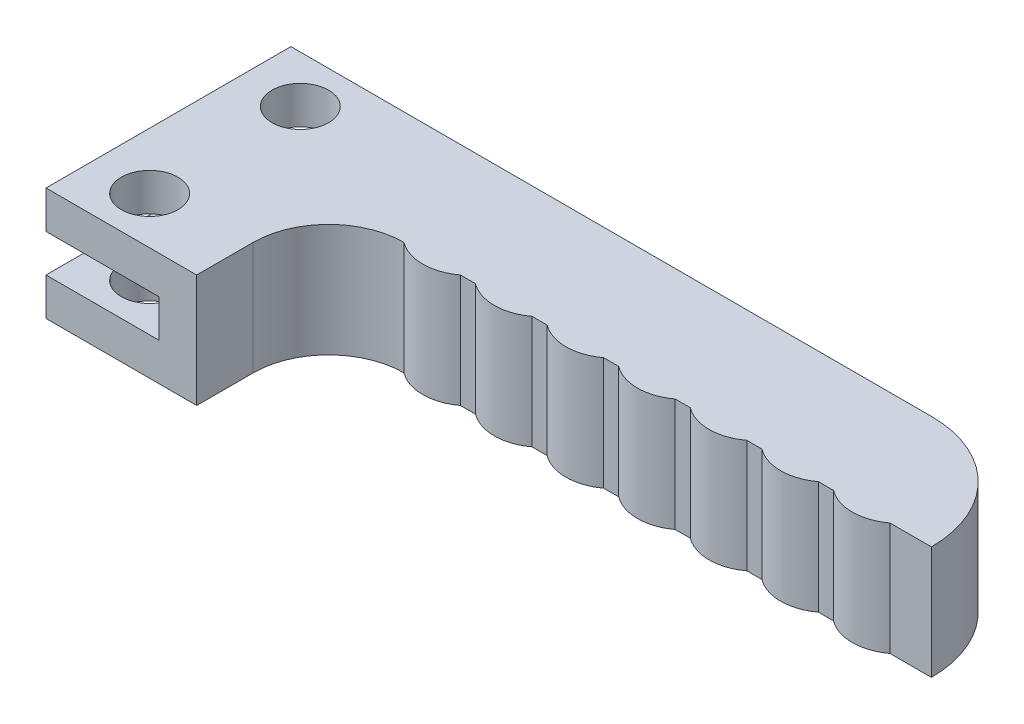
ISO-10303-21;
HEADER;
FILE_DESCRIPTION(('STEP AP214'),'2;1');
FILE_NAME('part.step','',(''),(''),'','','');
FILE_SCHEMA(('AUTOMOTIVE_DESIGN { 1 0 10303 214 1 1 1 1 }'));
ENDSEC;
DATA;
#1=APPLICATION_CONTEXT('core data for automotive mechanical design processes');
#2=APPLICATION_PROTOCOL_DEFINITION('international standard','automotive_design',2000,#1);
#3=PRODUCT_CONTEXT('',#1,'mechanical');
#4=PRODUCT('Part','Part','',(#3));
#5=PRODUCT_RELATED_PRODUCT_CATEGORY('part','',(#4));
#6=PRODUCT_DEFINITION_FORMATION('','',#4);
#7=PRODUCT_DEFINITION_CONTEXT('part definition',#1,'design');
#8=PRODUCT_DEFINITION('design','',#6,#7);
#9=PRODUCT_DEFINITION_SHAPE('','',#8);
#10=(LENGTH_UNIT() NAMED_UNIT(*) SI_UNIT(.MILLI.,.METRE.));
#11=(NAMED_UNIT(*) PLANE_ANGLE_UNIT() SI_UNIT($,.RADIAN.));
#12=(NAMED_UNIT(*) SI_UNIT($,.STERADIAN.) SOLID_ANGLE_UNIT());
#13=UNCERTAINTY_MEASURE_WITH_UNIT(LENGTH_MEASURE(1.E-05),#10,'distance_accuracy_value','');
#14=(GEOMETRIC_REPRESENTATION_CONTEXT(3) GLOBAL_UNCERTAINTY_ASSIGNED_CONTEXT((#13)) GLOBAL_UNIT_ASSIGNED_CONTEXT((#10,
#11,#12)) REPRESENTATION_CONTEXT('',''));
#15=CARTESIAN_POINT('',(0.,0.,0.));
#16=DIRECTION('',(0.,0.,1.));
#17=DIRECTION('',(1.,0.,0.));
#18=AXIS2_PLACEMENT_3D('',#15,#16,#17);
#19=CARTESIAN_POINT('',(-6.50000000000003,0.,-2.50000000000002));
#20=DIRECTION('',(0.,1.,0.));
#21=DIRECTION('',(0.,0.,1.));
#22=AXIS2_PLACEMENT_3D('',#19,#20,#21);
#23=CYLINDRICAL_SURFACE('',#22,2.50000000000001);
#24=CARTESIAN_POINT('',(-6.50000000000003,0.,-2.50000000000002));
#25=DIRECTION('',(0.,1.,0.));
#26=DIRECTION('',(0.,0.,1.));
#27=AXIS2_PLACEMENT_3D('',#24,#25,#26);
#28=CIRCLE('',#27,2.50000000000001);
#29=CARTESIAN_POINT('',(-8.00000000000002,0.,-0.5));
#30=VERTEX_POINT('',#29);
#31=CARTESIAN_POINT('',(-5.00000000000004,0.,-0.5));
#32=VERTEX_POINT('',#31);
#33=EDGE_CURVE('E11',#30,#32,#28,.T.);
#34=ORIENTED_EDGE('',*,*,#33,.T.);
#35=DIRECTION('',(0.,1.,0.));
#36=VECTOR('',#35,1.);
#37=CARTESIAN_POINT('',(-5.00000000000004,0.,-0.5));
#38=LINE('',#37,#36);
#39=CARTESIAN_POINT('',(-5.00000000000004,6.,-0.5));
#40=VERTEX_POINT('',#39);
#41=EDGE_CURVE('E373',#32,#40,#38,.T.);
#42=ORIENTED_EDGE('',*,*,#41,.T.);
#43=CARTESIAN_POINT('',(-6.50000000000003,6.,-2.50000000000002));
#44=DIRECTION('',(0.,1.,0.));
#45=DIRECTION('',(0.,0.,1.));
#46=AXIS2_PLACEMENT_3D('',#43,#44,#45);
#47=CIRCLE('',#46,2.50000000000001);
#48=CARTESIAN_POINT('',(-8.,6.,-0.5));
#49=VERTEX_POINT('',#48);
#50=EDGE_CURVE('E36',#49,#40,#47,.T.);
#51=ORIENTED_EDGE('',*,*,#50,.F.);
#52=DIRECTION('',(0.,-1.,0.));
#53=VECTOR('',#52,1.);
#54=CARTESIAN_POINT('',(-8.,0.,-0.5));
#55=LINE('',#54,#53);
#56=EDGE_CURVE('E27',#49,#30,#55,.T.);
#57=ORIENTED_EDGE('',*,*,#56,.T.);
#58=EDGE_LOOP('',(#34,#42,#51,#57));
#59=FACE_BOUND('',#58,.T.);
#60=ADVANCED_FACE('F17',(#59),#23,.T.);
#61=CARTESIAN_POINT('',(-2.70000000000003,0.,-2.50000000000004));
#62=DIRECTION('',(0.,1.,0.));
#63=DIRECTION('',(0.,0.,1.));
#64=AXIS2_PLACEMENT_3D('',#61,#62,#63);
#65=CYLINDRICAL_SURFACE('',#64,2.5);
#66=CARTESIAN_POINT('',(-2.70000000000003,0.,-2.50000000000004));
#67=DIRECTION('',(0.,1.,0.));
#68=DIRECTION('',(0.,0.,1.));
#69=AXIS2_PLACEMENT_3D('',#66,#67,#68);
#70=CIRCLE('',#69,2.5);
#71=CARTESIAN_POINT('',(-4.20000000000002,0.,-0.5));
#72=VERTEX_POINT('',#71);
#73=CARTESIAN_POINT('',(-1.20000000000004,0.,-0.500000000000025));
#74=VERTEX_POINT('',#73);
#75=EDGE_CURVE('E708',#72,#74,#70,.T.);
#76=ORIENTED_EDGE('',*,*,#75,.T.);
#77=DIRECTION('',(0.,1.,0.));
#78=VECTOR('',#77,1.);
#79=CARTESIAN_POINT('',(-1.20000000000004,0.,-0.500000000000025));
#80=LINE('',#79,#78);
#81=CARTESIAN_POINT('',(-1.20000000000004,6.,-0.500000000000025));
#82=VERTEX_POINT('',#81);
#83=EDGE_CURVE('E375',#74,#82,#80,.T.);
#84=ORIENTED_EDGE('',*,*,#83,.T.);
#85=CARTESIAN_POINT('',(-2.70000000000003,6.,-2.50000000000004));
#86=DIRECTION('',(0.,1.,0.));
#87=DIRECTION('',(0.,0.,1.));
#88=AXIS2_PLACEMENT_3D('',#85,#86,#87);
#89=CIRCLE('',#88,2.5);
#90=CARTESIAN_POINT('',(-4.20000000000002,6.,-0.500000000000025));
#91=VERTEX_POINT('',#90);
#92=EDGE_CURVE('E715',#91,#82,#89,.T.);
#93=ORIENTED_EDGE('',*,*,#92,.F.);
#94=DIRECTION('',(0.,1.,0.));
#95=VECTOR('',#94,1.);
#96=CARTESIAN_POINT('',(-4.20000000000002,0.,-0.500000000000025));
#97=LINE('',#96,#95);
#98=EDGE_CURVE('E372',#72,#91,#97,.T.);
#99=ORIENTED_EDGE('',*,*,#98,.F.);
#100=EDGE_LOOP('',(#76,#84,#93,#99));
#101=FACE_BOUND('',#100,.T.);
#102=ADVANCED_FACE('F448',(#101),#65,.T.);
#103=CARTESIAN_POINT('',(1.09999999999997,0.,-2.50000000000006));
#104=DIRECTION('',(0.,1.,0.));
#105=DIRECTION('',(0.,0.,1.));
#106=AXIS2_PLACEMENT_3D('',#103,#104,#105);
#107=CYLINDRICAL_SURFACE('',#106,2.5);
#108=CARTESIAN_POINT('',(1.09999999999997,0.,-2.50000000000006));
#109=DIRECTION('',(0.,1.,0.));
#110=DIRECTION('',(0.,0.,1.));
#111=AXIS2_PLACEMENT_3D('',#108,#109,#110);
#112=CIRCLE('',#111,2.5);
#113=CARTESIAN_POINT('',(-0.400000000000022,0.,-0.500000000000001));
#114=VERTEX_POINT('',#113);
#115=CARTESIAN_POINT('',(2.59999999999995,0.,-0.500000000000053));
#116=VERTEX_POINT('',#115);
#117=EDGE_CURVE('E421',#114,#116,#112,.T.);
#118=ORIENTED_EDGE('',*,*,#117,.T.);
#119=DIRECTION('',(0.,1.,0.));
#120=VECTOR('',#119,1.);
#121=CARTESIAN_POINT('',(2.59999999999995,0.,-0.500000000000053));
#122=LINE('',#121,#120);
#123=CARTESIAN_POINT('',(2.59999999999995,6.,-0.500000000000053));
#124=VERTEX_POINT('',#123);
#125=EDGE_CURVE('E384',#116,#124,#122,.T.);
#126=ORIENTED_EDGE('',*,*,#125,.T.);
#127=CARTESIAN_POINT('',(1.09999999999997,6.,-2.50000000000006));
#128=DIRECTION('',(0.,1.,0.));
#129=DIRECTION('',(0.,0.,1.));
#130=AXIS2_PLACEMENT_3D('',#127,#128,#129);
#131=CIRCLE('',#130,2.5);
#132=CARTESIAN_POINT('',(-0.400000000000022,6.,-0.500000000000053));
#133=VERTEX_POINT('',#132);
#134=EDGE_CURVE('E701',#133,#124,#131,.T.);
#135=ORIENTED_EDGE('',*,*,#134,.F.);
#136=DIRECTION('',(0.,1.,0.));
#137=VECTOR('',#136,1.);
#138=CARTESIAN_POINT('',(-0.400000000000022,0.,-0.500000000000053));
#139=LINE('',#138,#137);
#140=EDGE_CURVE('E381',#114,#133,#139,.T.);
#141=ORIENTED_EDGE('',*,*,#140,.F.);
#142=EDGE_LOOP('',(#118,#126,#135,#141));
#143=FACE_BOUND('',#142,.T.);
#144=ADVANCED_FACE('F453',(#143),#107,.T.);
#145=CARTESIAN_POINT('',(4.89999999999997,0.,-2.50000000000009));
#146=DIRECTION('',(0.,1.,0.));
#147=DIRECTION('',(0.,0.,1.));
#148=AXIS2_PLACEMENT_3D('',#145,#146,#147);
#149=CYLINDRICAL_SURFACE('',#148,2.5);
#150=CARTESIAN_POINT('',(4.89999999999997,0.,-2.50000000000009));
#151=DIRECTION('',(0.,1.,0.));
#152=DIRECTION('',(0.,0.,1.));
#153=AXIS2_PLACEMENT_3D('',#150,#151,#152);
#154=CIRCLE('',#153,2.5);
#155=CARTESIAN_POINT('',(3.39999999999998,0.,-0.500000000000001));
#156=VERTEX_POINT('',#155);
#157=CARTESIAN_POINT('',(6.39999999999996,0.,-0.50000000000008));
#158=VERTEX_POINT('',#157);
#159=EDGE_CURVE('E419',#156,#158,#154,.T.);
#160=ORIENTED_EDGE('',*,*,#159,.T.);
#161=DIRECTION('',(0.,1.,0.));
#162=VECTOR('',#161,1.);
#163=CARTESIAN_POINT('',(6.39999999999996,0.,-0.50000000000008));
#164=LINE('',#163,#162);
#165=CARTESIAN_POINT('',(6.39999999999996,6.,-0.50000000000008));
#166=VERTEX_POINT('',#165);
#167=EDGE_CURVE('E226',#158,#166,#164,.T.);
#168=ORIENTED_EDGE('',*,*,#167,.T.);
#169=CARTESIAN_POINT('',(4.89999999999997,6.,-2.50000000000009));
#170=DIRECTION('',(0.,1.,0.));
#171=DIRECTION('',(0.,0.,1.));
#172=AXIS2_PLACEMENT_3D('',#169,#170,#171);
#173=CIRCLE('',#172,2.5);
#174=CARTESIAN_POINT('',(3.39999999999998,6.,-0.50000000000008));
#175=VERTEX_POINT('',#174);
#176=EDGE_CURVE('E428',#175,#166,#173,.T.);
#177=ORIENTED_EDGE('',*,*,#176,.F.);
#178=DIRECTION('',(0.,1.,0.));
#179=VECTOR('',#178,1.);
#180=CARTESIAN_POINT('',(3.39999999999998,0.,-0.50000000000008));
#181=LINE('',#180,#179);
#182=EDGE_CURVE('E391',#156,#175,#181,.T.);
#183=ORIENTED_EDGE('',*,*,#182,.F.);
#184=EDGE_LOOP('',(#160,#168,#177,#183));
#185=FACE_BOUND('',#184,.T.);
#186=ADVANCED_FACE('F459',(#185),#149,.T.);
#187=CARTESIAN_POINT('',(8.69999999999997,0.,-2.50000000000012));
#188=DIRECTION('',(0.,1.,0.));
#189=DIRECTION('',(0.,0.,1.));
#190=AXIS2_PLACEMENT_3D('',#187,#188,#189);
#191=CYLINDRICAL_SURFACE('',#190,2.5);
#192=CARTESIAN_POINT('',(8.69999999999997,0.,-2.50000000000012));
#193=DIRECTION('',(0.,1.,0.));
#194=DIRECTION('',(0.,0.,1.));
#195=AXIS2_PLACEMENT_3D('',#192,#193,#194);
#196=CIRCLE('',#195,2.5);
#197=CARTESIAN_POINT('',(7.19999999999998,0.,-0.500000000000002));
#198=VERTEX_POINT('',#197);
#199=CARTESIAN_POINT('',(10.2,0.,-0.500000000000105));
#200=VERTEX_POINT('',#199);
#201=EDGE_CURVE('E409',#198,#200,#196,.T.);
#202=ORIENTED_EDGE('',*,*,#201,.T.);
#203=DIRECTION('',(0.,1.,0.));
#204=VECTOR('',#203,1.);
#205=CARTESIAN_POINT('',(10.2,0.,-0.500000000000105));
#206=LINE('',#205,#204);
#207=CARTESIAN_POINT('',(10.2,6.,-0.500000000000105));
#208=VERTEX_POINT('',#207);
#209=EDGE_CURVE('E220',#200,#208,#206,.T.);
#210=ORIENTED_EDGE('',*,*,#209,.T.);
#211=CARTESIAN_POINT('',(8.69999999999997,6.,-2.50000000000012));
#212=DIRECTION('',(0.,1.,0.));
#213=DIRECTION('',(0.,0.,1.));
#214=AXIS2_PLACEMENT_3D('',#211,#212,#213);
#215=CIRCLE('',#214,2.5);
#216=CARTESIAN_POINT('',(7.19999999999998,6.,-0.500000000000105));
#217=VERTEX_POINT('',#216);
#218=EDGE_CURVE('E417',#217,#208,#215,.T.);
#219=ORIENTED_EDGE('',*,*,#218,.F.);
#220=DIRECTION('',(0.,1.,0.));
#221=VECTOR('',#220,1.);
#222=CARTESIAN_POINT('',(7.19999999999998,0.,-0.500000000000105));
#223=LINE('',#222,#221);
#224=EDGE_CURVE('E400',#198,#217,#223,.T.);
#225=ORIENTED_EDGE('',*,*,#224,.F.);
#226=EDGE_LOOP('',(#202,#210,#219,#225));
#227=FACE_BOUND('',#226,.T.);
#228=ADVANCED_FACE('F416',(#227),#191,.T.);
#229=CARTESIAN_POINT('',(12.5,0.,-2.50000000000015));
#230=DIRECTION('',(0.,1.,0.));
#231=DIRECTION('',(0.,0.,1.));
#232=AXIS2_PLACEMENT_3D('',#229,#230,#231);
#233=CYLINDRICAL_SURFACE('',#232,2.5);
#234=CARTESIAN_POINT('',(12.5,0.,-2.50000000000015));
#235=DIRECTION('',(0.,1.,0.));
#236=DIRECTION('',(0.,0.,1.));
#237=AXIS2_PLACEMENT_3D('',#234,#235,#236);
#238=CIRCLE('',#237,2.5);
#239=CARTESIAN_POINT('',(11.,0.,-0.500000000000002));
#240=VERTEX_POINT('',#239);
#241=CARTESIAN_POINT('',(14.,0.,-0.500000000000132));
#242=VERTEX_POINT('',#241);
#243=EDGE_CURVE('E333',#240,#242,#238,.T.);
#244=ORIENTED_EDGE('',*,*,#243,.T.);
#245=DIRECTION('',(0.,1.,0.));
#246=VECTOR('',#245,1.);
#247=CARTESIAN_POINT('',(14.,0.,-0.500000000000132));
#248=LINE('',#247,#246);
#249=CARTESIAN_POINT('',(14.,6.,-0.500000000000132));
#250=VERTEX_POINT('',#249);
#251=EDGE_CURVE('E216',#242,#250,#248,.T.);
#252=ORIENTED_EDGE('',*,*,#251,.T.);
#253=CARTESIAN_POINT('',(12.5,6.,-2.50000000000015));
#254=DIRECTION('',(0.,1.,0.));
#255=DIRECTION('',(0.,0.,1.));
#256=AXIS2_PLACEMENT_3D('',#253,#254,#255);
#257=CIRCLE('',#256,2.5);
#258=CARTESIAN_POINT('',(11.,6.,-0.500000000000132));
#259=VERTEX_POINT('',#258);
#260=EDGE_CURVE('E429',#259,#250,#257,.T.);
#261=ORIENTED_EDGE('',*,*,#260,.F.);
#262=DIRECTION('',(0.,1.,0.));
#263=VECTOR('',#262,1.);
#264=CARTESIAN_POINT('',(11.,0.,-0.500000000000132));
#265=LINE('',#264,#263);
#266=EDGE_CURVE('E341',#240,#259,#265,.T.);
#267=ORIENTED_EDGE('',*,*,#266,.F.);
#268=EDGE_LOOP('',(#244,#252,#261,#267));
#269=FACE_BOUND('',#268,.T.);
#270=ADVANCED_FACE('F436',(#269),#233,.T.);
#271=CARTESIAN_POINT('',(16.3,0.,-2.50000000000018));
#272=DIRECTION('',(0.,1.,0.));
#273=DIRECTION('',(0.,0.,1.));
#274=AXIS2_PLACEMENT_3D('',#271,#272,#273);
#275=CYLINDRICAL_SURFACE('',#274,2.5);
#276=CARTESIAN_POINT('',(16.3,0.,-2.50000000000018));
#277=DIRECTION('',(0.,1.,0.));
#278=DIRECTION('',(0.,0.,1.));
#279=AXIS2_PLACEMENT_3D('',#276,#277,#278);
#280=CIRCLE('',#279,2.5);
#281=CARTESIAN_POINT('',(14.8,0.,-0.500000000000003));
#282=VERTEX_POINT('',#281);
#283=CARTESIAN_POINT('',(17.7999999999999,0.,-0.500000000000003));
#284=VERTEX_POINT('',#283);
#285=EDGE_CURVE('E174',#282,#284,#280,.T.);
#286=ORIENTED_EDGE('',*,*,#285,.T.);
#287=DIRECTION('',(0.,1.,0.));
#288=VECTOR('',#287,1.);
#289=CARTESIAN_POINT('',(17.7999999999999,0.,-0.500000000000157));
#290=LINE('',#289,#288);
#291=CARTESIAN_POINT('',(17.7999999999999,6.,-0.500000000000003));
#292=VERTEX_POINT('',#291);
#293=EDGE_CURVE('E215',#284,#292,#290,.T.);
#294=ORIENTED_EDGE('',*,*,#293,.T.);
#295=CARTESIAN_POINT('',(16.3,6.,-2.50000000000018));
#296=DIRECTION('',(0.,1.,0.));
#297=DIRECTION('',(0.,0.,1.));
#298=AXIS2_PLACEMENT_3D('',#295,#296,#297);
#299=CIRCLE('',#298,2.5);
#300=CARTESIAN_POINT('',(14.8,6.,-0.500000000000157));
#301=VERTEX_POINT('',#300);
#302=EDGE_CURVE('E348',#301,#292,#299,.T.);
#303=ORIENTED_EDGE('',*,*,#302,.F.);
#304=DIRECTION('',(0.,1.,0.));
#305=VECTOR('',#304,1.);
#306=CARTESIAN_POINT('',(14.8,0.,-0.500000000000157));
#307=LINE('',#306,#305);
#308=EDGE_CURVE('E240',#282,#301,#307,.T.);
#309=ORIENTED_EDGE('',*,*,#308,.F.);
#310=EDGE_LOOP('',(#286,#294,#303,#309));
#311=FACE_BOUND('',#310,.T.);
#312=ADVANCED_FACE('F433',(#311),#275,.T.);
#313=CARTESIAN_POINT('',(-17.,0.,4.));
#314=DIRECTION('',(0.,1.,0.));
#315=DIRECTION('',(0.,0.,1.));
#316=AXIS2_PLACEMENT_3D('',#313,#314,#315);
#317=CYLINDRICAL_SURFACE('',#316,1.5);
#318=CARTESIAN_POINT('',(-17.,2.,4.));
#319=DIRECTION('',(0.,1.,0.));
#320=DIRECTION('',(0.,0.,1.));
#321=AXIS2_PLACEMENT_3D('',#318,#319,#320);
#322=CIRCLE('',#321,1.5);
#323=CARTESIAN_POINT('',(-17.,2.,5.5));
#324=VERTEX_POINT('',#323);
#325=EDGE_CURVE('E334',#324,#324,#322,.T.);
#326=ORIENTED_EDGE('',*,*,#325,.T.);
#327=EDGE_LOOP('',(#326));
#328=FACE_BOUND('',#327,.T.);
#329=CARTESIAN_POINT('',(-17.,0.,4.));
#330=DIRECTION('',(0.,1.,0.));
#331=DIRECTION('',(0.,0.,1.));
#332=AXIS2_PLACEMENT_3D('',#329,#330,#331);
#333=CIRCLE('',#332,1.5);
#334=CARTESIAN_POINT('',(-17.,0.,5.5));
#335=VERTEX_POINT('',#334);
#336=EDGE_CURVE('E349',#335,#335,#333,.T.);
#337=ORIENTED_EDGE('',*,*,#336,.F.);
#338=EDGE_LOOP('',(#337));
#339=FACE_BOUND('',#338,.T.);
#340=ADVANCED_FACE('F435',(#328,#339),#317,.F.);
#341=CARTESIAN_POINT('',(-17.,0.,-4.));
#342=DIRECTION('',(0.,1.,0.));
#343=DIRECTION('',(0.,0.,1.));
#344=AXIS2_PLACEMENT_3D('',#341,#342,#343);
#345=CYLINDRICAL_SURFACE('',#344,1.5);
#346=CARTESIAN_POINT('',(-17.,2.,-4.));
#347=DIRECTION('',(0.,1.,0.));
#348=DIRECTION('',(0.,0.,1.));
#349=AXIS2_PLACEMENT_3D('',#346,#347,#348);
#350=CIRCLE('',#349,1.5);
#351=CARTESIAN_POINT('',(-17.,2.,-2.5));
#352=VERTEX_POINT('',#351);
#353=EDGE_CURVE('E354',#352,#352,#350,.T.);
#354=ORIENTED_EDGE('',*,*,#353,.T.);
#355=EDGE_LOOP('',(#354));
#356=FACE_BOUND('',#355,.T.);
#357=CARTESIAN_POINT('',(-17.,0.,-4.));
#358=DIRECTION('',(0.,1.,0.));
#359=DIRECTION('',(0.,0.,1.));
#360=AXIS2_PLACEMENT_3D('',#357,#358,#359);
#361=CIRCLE('',#360,1.5);
#362=CARTESIAN_POINT('',(-17.,0.,-2.5));
#363=VERTEX_POINT('',#362);
#364=EDGE_CURVE('E296',#363,#363,#361,.T.);
#365=ORIENTED_EDGE('',*,*,#364,.F.);
#366=EDGE_LOOP('',(#365));
#367=FACE_BOUND('',#366,.T.);
#368=ADVANCED_FACE('F443',(#356,#367),#345,.F.);
#369=CARTESIAN_POINT('',(-17.,4.,4.));
#370=DIRECTION('',(0.,1.,0.));
#371=DIRECTION('',(0.,0.,1.));
#372=AXIS2_PLACEMENT_3D('',#369,#370,#371);
#373=CYLINDRICAL_SURFACE('',#372,1.5);
#374=CARTESIAN_POINT('',(-17.,6.,4.));
#375=DIRECTION('',(0.,1.,0.));
#376=DIRECTION('',(0.,0.,1.));
#377=AXIS2_PLACEMENT_3D('',#374,#375,#376);
#378=CIRCLE('',#377,1.5);
#379=CARTESIAN_POINT('',(-17.,6.,5.5));
#380=VERTEX_POINT('',#379);
#381=EDGE_CURVE('E359',#380,#380,#378,.T.);
#382=ORIENTED_EDGE('',*,*,#381,.T.);
#383=EDGE_LOOP('',(#382));
#384=FACE_BOUND('',#383,.T.);
#385=CARTESIAN_POINT('',(-17.,4.,4.));
#386=DIRECTION('',(0.,1.,0.));
#387=DIRECTION('',(0.,0.,1.));
#388=AXIS2_PLACEMENT_3D('',#385,#386,#387);
#389=CIRCLE('',#388,1.5);
#390=CARTESIAN_POINT('',(-17.,4.,5.5));
#391=VERTEX_POINT('',#390);
#392=EDGE_CURVE('E192',#391,#391,#389,.T.);
#393=ORIENTED_EDGE('',*,*,#392,.F.);
#394=EDGE_LOOP('',(#393));
#395=FACE_BOUND('',#394,.T.);
#396=ADVANCED_FACE('F497',(#384,#395),#373,.F.);
#397=CARTESIAN_POINT('',(-17.,4.,-4.));
#398=DIRECTION('',(0.,1.,0.));
#399=DIRECTION('',(0.,0.,1.));
#400=AXIS2_PLACEMENT_3D('',#397,#398,#399);
#401=CYLINDRICAL_SURFACE('',#400,1.5);
#402=CARTESIAN_POINT('',(-17.,6.,-4.));
#403=DIRECTION('',(0.,1.,0.));
#404=DIRECTION('',(0.,0.,1.));
#405=AXIS2_PLACEMENT_3D('',#402,#403,#404);
#406=CIRCLE('',#405,1.5);
#407=CARTESIAN_POINT('',(-17.,6.,-2.5));
#408=VERTEX_POINT('',#407);
#409=EDGE_CURVE('E364',#408,#408,#406,.T.);
#410=ORIENTED_EDGE('',*,*,#409,.T.);
#411=EDGE_LOOP('',(#410));
#412=FACE_BOUND('',#411,.T.);
#413=CARTESIAN_POINT('',(-17.,4.,-4.));
#414=DIRECTION('',(0.,1.,0.));
#415=DIRECTION('',(0.,0.,1.));
#416=AXIS2_PLACEMENT_3D('',#413,#414,#415);
#417=CIRCLE('',#416,1.5);
#418=CARTESIAN_POINT('',(-17.,4.,-2.5));
#419=VERTEX_POINT('',#418);
#420=EDGE_CURVE('E266',#419,#419,#417,.T.);
#421=ORIENTED_EDGE('',*,*,#420,.F.);
#422=EDGE_LOOP('',(#421));
#423=FACE_BOUND('',#422,.T.);
#424=ADVANCED_FACE('F507',(#412,#423),#401,.F.);
#425=CARTESIAN_POINT('',(20.,0.,-0.500000000000003));
#426=DIRECTION('',(0.,0.,-1.));
#427=DIRECTION('',(-1.,0.,0.));
#428=AXIS2_PLACEMENT_3D('',#425,#426,#427);
#429=PLANE('',#428);
#430=DIRECTION('',(-1.,0.,0.));
#431=VECTOR('',#430,1.);
#432=CARTESIAN_POINT('',(20.,6.,-0.500000000000003));
#433=LINE('',#432,#431);
#434=EDGE_CURVE('E369',#91,#40,#433,.T.);
#435=ORIENTED_EDGE('',*,*,#434,.T.);
#436=ORIENTED_EDGE('',*,*,#41,.F.);
#437=DIRECTION('',(-1.,0.,0.));
#438=VECTOR('',#437,1.);
#439=CARTESIAN_POINT('',(20.,0.,-0.500000000000003));
#440=LINE('',#439,#438);
#441=EDGE_CURVE('E199',#72,#32,#440,.T.);
#442=ORIENTED_EDGE('',*,*,#441,.F.);
#443=ORIENTED_EDGE('',*,*,#98,.T.);
#444=EDGE_LOOP('',(#435,#436,#442,#443));
#445=FACE_BOUND('',#444,.T.);
#446=ADVANCED_FACE('F517',(#445),#429,.F.);
#447=CARTESIAN_POINT('',(20.,0.,-0.500000000000003));
#448=DIRECTION('',(0.,0.,-1.));
#449=DIRECTION('',(-1.,0.,0.));
#450=AXIS2_PLACEMENT_3D('',#447,#448,#449);
#451=PLANE('',#450);
#452=DIRECTION('',(-1.,0.,0.));
#453=VECTOR('',#452,1.);
#454=CARTESIAN_POINT('',(20.,6.,-0.500000000000003));
#455=LINE('',#454,#453);
#456=EDGE_CURVE('E378',#133,#82,#455,.T.);
#457=ORIENTED_EDGE('',*,*,#456,.T.);
#458=ORIENTED_EDGE('',*,*,#83,.F.);
#459=DIRECTION('',(-1.,0.,0.));
#460=VECTOR('',#459,1.);
#461=CARTESIAN_POINT('',(20.,0.,-0.500000000000003));
#462=LINE('',#461,#460);
#463=EDGE_CURVE('E377',#114,#74,#462,.T.);
#464=ORIENTED_EDGE('',*,*,#463,.F.);
#465=ORIENTED_EDGE('',*,*,#140,.T.);
#466=EDGE_LOOP('',(#457,#458,#464,#465));
#467=FACE_BOUND('',#466,.T.);
#468=ADVANCED_FACE('F527',(#467),#451,.F.);
#469=CARTESIAN_POINT('',(20.,0.,-0.500000000000003));
#470=DIRECTION('',(0.,0.,-1.));
#471=DIRECTION('',(-1.,0.,0.));
#472=AXIS2_PLACEMENT_3D('',#469,#470,#471);
#473=PLANE('',#472);
#474=DIRECTION('',(-1.,0.,0.));
#475=VECTOR('',#474,1.);
#476=CARTESIAN_POINT('',(20.,6.,-0.500000000000003));
#477=LINE('',#476,#475);
#478=EDGE_CURVE('E388',#175,#124,#477,.T.);
#479=ORIENTED_EDGE('',*,*,#478,.T.);
#480=ORIENTED_EDGE('',*,*,#125,.F.);
#481=DIRECTION('',(-1.,0.,0.));
#482=VECTOR('',#481,1.);
#483=CARTESIAN_POINT('',(20.,0.,-0.500000000000003));
#484=LINE('',#483,#482);
#485=EDGE_CURVE('E387',#156,#116,#484,.T.);
#486=ORIENTED_EDGE('',*,*,#485,.F.);
#487=ORIENTED_EDGE('',*,*,#182,.T.);
#488=EDGE_LOOP('',(#479,#480,#486,#487));
#489=FACE_BOUND('',#488,.T.);
#490=ADVANCED_FACE('F537',(#489),#473,.F.);
#491=CARTESIAN_POINT('',(20.,0.,-0.500000000000003));
#492=DIRECTION('',(0.,0.,-1.));
#493=DIRECTION('',(-1.,0.,0.));
#494=AXIS2_PLACEMENT_3D('',#491,#492,#493);
#495=PLANE('',#494);
#496=DIRECTION('',(-1.,0.,0.));
#497=VECTOR('',#496,1.);
#498=CARTESIAN_POINT('',(20.,6.,-0.500000000000003));
#499=LINE('',#498,#497);
#500=EDGE_CURVE('E397',#217,#166,#499,.T.);
#501=ORIENTED_EDGE('',*,*,#500,.T.);
#502=ORIENTED_EDGE('',*,*,#167,.F.);
#503=DIRECTION('',(-1.,0.,0.));
#504=VECTOR('',#503,1.);
#505=CARTESIAN_POINT('',(20.,0.,-0.500000000000003));
#506=LINE('',#505,#504);
#507=EDGE_CURVE('E396',#198,#158,#506,.T.);
#508=ORIENTED_EDGE('',*,*,#507,.F.);
#509=ORIENTED_EDGE('',*,*,#224,.T.);
#510=EDGE_LOOP('',(#501,#502,#508,#509));
#511=FACE_BOUND('',#510,.T.);
#512=ADVANCED_FACE('F547',(#511),#495,.F.);
#513=CARTESIAN_POINT('',(20.,0.,-0.500000000000003));
#514=DIRECTION('',(0.,0.,-1.));
#515=DIRECTION('',(-1.,0.,0.));
#516=AXIS2_PLACEMENT_3D('',#513,#514,#515);
#517=PLANE('',#516);
#518=DIRECTION('',(-1.,0.,0.));
#519=VECTOR('',#518,1.);
#520=CARTESIAN_POINT('',(20.,6.,-0.500000000000003));
#521=LINE('',#520,#519);
#522=EDGE_CURVE('E343',#259,#208,#521,.T.);
#523=ORIENTED_EDGE('',*,*,#522,.T.);
#524=ORIENTED_EDGE('',*,*,#209,.F.);
#525=DIRECTION('',(-1.,0.,0.));
#526=VECTOR('',#525,1.);
#527=CARTESIAN_POINT('',(20.,0.,-0.500000000000003));
#528=LINE('',#527,#526);
#529=EDGE_CURVE('E236',#240,#200,#528,.T.);
#530=ORIENTED_EDGE('',*,*,#529,.F.);
#531=ORIENTED_EDGE('',*,*,#266,.T.);
#532=EDGE_LOOP('',(#523,#524,#530,#531));
#533=FACE_BOUND('',#532,.T.);
#534=ADVANCED_FACE('F413',(#533),#517,.F.);
#535=CARTESIAN_POINT('',(20.,0.,-0.500000000000003));
#536=DIRECTION('',(0.,0.,-1.));
#537=DIRECTION('',(-1.,0.,0.));
#538=AXIS2_PLACEMENT_3D('',#535,#536,#537);
#539=PLANE('',#538);
#540=DIRECTION('',(-1.,0.,0.));
#541=VECTOR('',#540,1.);
#542=CARTESIAN_POINT('',(20.,6.,-0.500000000000003));
#543=LINE('',#542,#541);
#544=EDGE_CURVE('E230',#301,#250,#543,.T.);
#545=ORIENTED_EDGE('',*,*,#544,.T.);
#546=ORIENTED_EDGE('',*,*,#251,.F.);
#547=DIRECTION('',(-1.,0.,0.));
#548=VECTOR('',#547,1.);
#549=CARTESIAN_POINT('',(20.,0.,-0.500000000000003));
#550=LINE('',#549,#548);
#551=EDGE_CURVE('E232',#282,#242,#550,.T.);
#552=ORIENTED_EDGE('',*,*,#551,.F.);
#553=ORIENTED_EDGE('',*,*,#308,.T.);
#554=EDGE_LOOP('',(#545,#546,#552,#553));
#555=FACE_BOUND('',#554,.T.);
#556=ADVANCED_FACE('F338',(#555),#539,.F.);
#557=CARTESIAN_POINT('',(-20.,6.,6.5));
#558=DIRECTION('',(1.,0.,0.));
#559=DIRECTION('',(0.,0.,-1.));
#560=AXIS2_PLACEMENT_3D('',#557,#558,#559);
#561=PLANE('',#560);
#562=DIRECTION('',(0.,-1.,0.));
#563=VECTOR('',#562,1.);
#564=CARTESIAN_POINT('',(-20.,6.,-6.5));
#565=LINE('',#564,#563);
#566=CARTESIAN_POINT('',(-20.,6.,-6.5));
#567=VERTEX_POINT('',#566);
#568=CARTESIAN_POINT('',(-20.,4.,-6.5));
#569=VERTEX_POINT('',#568);
#570=EDGE_CURVE('E237',#567,#569,#565,.T.);
#571=ORIENTED_EDGE('',*,*,#570,.T.);
#572=DIRECTION('',(0.,0.,1.));
#573=VECTOR('',#572,1.);
#574=CARTESIAN_POINT('',(-20.,4.,-6.5));
#575=LINE('',#574,#573);
#576=CARTESIAN_POINT('',(-20.,4.,6.5));
#577=VERTEX_POINT('',#576);
#578=EDGE_CURVE('E241',#569,#577,#575,.T.);
#579=ORIENTED_EDGE('',*,*,#578,.T.);
#580=DIRECTION('',(0.,-1.,0.));
#581=VECTOR('',#580,1.);
#582=CARTESIAN_POINT('',(-20.,6.,6.5));
#583=LINE('',#582,#581);
#584=CARTESIAN_POINT('',(-20.,6.,6.5));
#585=VERTEX_POINT('',#584);
#586=EDGE_CURVE('E245',#585,#577,#583,.T.);
#587=ORIENTED_EDGE('',*,*,#586,.F.);
#588=DIRECTION('',(0.,0.,1.));
#589=VECTOR('',#588,1.);
#590=CARTESIAN_POINT('',(-20.,6.,6.5));
#591=LINE('',#590,#589);
#592=EDGE_CURVE('E248',#567,#585,#591,.T.);
#593=ORIENTED_EDGE('',*,*,#592,.F.);
#594=EDGE_LOOP('',(#571,#579,#587,#593));
#595=FACE_BOUND('',#594,.T.);
#596=ADVANCED_FACE('F313',(#595),#561,.F.);
#597=CARTESIAN_POINT('',(-20.,6.,6.5));
#598=DIRECTION('',(1.,0.,0.));
#599=DIRECTION('',(0.,0.,-1.));
#600=AXIS2_PLACEMENT_3D('',#597,#598,#599);
#601=PLANE('',#600);
#602=DIRECTION('',(0.,-1.,0.));
#603=VECTOR('',#602,1.);
#604=CARTESIAN_POINT('',(-20.,6.,6.5));
#605=LINE('',#604,#603);
#606=CARTESIAN_POINT('',(-20.,2.,6.5));
#607=VERTEX_POINT('',#606);
#608=CARTESIAN_POINT('',(-20.,0.,6.5));
#609=VERTEX_POINT('',#608);
#610=EDGE_CURVE('E247',#607,#609,#605,.T.);
#611=ORIENTED_EDGE('',*,*,#610,.F.);
#612=DIRECTION('',(0.,0.,1.));
#613=VECTOR('',#612,1.);
#614=CARTESIAN_POINT('',(-20.,2.,-6.5));
#615=LINE('',#614,#613);
#616=CARTESIAN_POINT('',(-20.,2.,-6.5));
#617=VERTEX_POINT('',#616);
#618=EDGE_CURVE('E205',#617,#607,#615,.T.);
#619=ORIENTED_EDGE('',*,*,#618,.F.);
#620=DIRECTION('',(0.,-1.,0.));
#621=VECTOR('',#620,1.);
#622=CARTESIAN_POINT('',(-20.,6.,-6.5));
#623=LINE('',#622,#621);
#624=CARTESIAN_POINT('',(-20.,0.,-6.5));
#625=VERTEX_POINT('',#624);
#626=EDGE_CURVE('E244',#617,#625,#623,.T.);
#627=ORIENTED_EDGE('',*,*,#626,.T.);
#628=DIRECTION('',(0.,0.,1.));
#629=VECTOR('',#628,1.);
#630=CARTESIAN_POINT('',(-20.,0.,6.5));
#631=LINE('',#630,#629);
#632=EDGE_CURVE('E256',#625,#609,#631,.T.);
#633=ORIENTED_EDGE('',*,*,#632,.T.);
#634=EDGE_LOOP('',(#611,#619,#627,#633));
#635=FACE_BOUND('',#634,.T.);
#636=ADVANCED_FACE('F323',(#635),#601,.F.);
#637=CARTESIAN_POINT('',(20.,6.,6.5));
#638=DIRECTION('',(0.,0.,-1.));
#639=DIRECTION('',(-1.,0.,0.));
#640=AXIS2_PLACEMENT_3D('',#637,#638,#639);
#641=PLANE('',#640);
#642=DIRECTION('',(1.,0.,0.));
#643=VECTOR('',#642,1.);
#644=CARTESIAN_POINT('',(20.,0.,6.5));
#645=LINE('',#644,#643);
#646=CARTESIAN_POINT('',(-12.,0.,6.5));
#647=VERTEX_POINT('',#646);
#648=EDGE_CURVE('E259',#609,#647,#645,.T.);
#649=ORIENTED_EDGE('',*,*,#648,.T.);
#650=DIRECTION('',(0.,1.,0.));
#651=VECTOR('',#650,1.);
#652=CARTESIAN_POINT('',(-12.,0.,6.5));
#653=LINE('',#652,#651);
#654=CARTESIAN_POINT('',(-12.,6.,6.5));
#655=VERTEX_POINT('',#654);
#656=EDGE_CURVE('E187',#647,#655,#653,.T.);
#657=ORIENTED_EDGE('',*,*,#656,.T.);
#658=DIRECTION('',(1.,0.,0.));
#659=VECTOR('',#658,1.);
#660=CARTESIAN_POINT('',(20.,6.,6.5));
#661=LINE('',#660,#659);
#662=EDGE_CURVE('E251',#585,#655,#661,.T.);
#663=ORIENTED_EDGE('',*,*,#662,.F.);
#664=ORIENTED_EDGE('',*,*,#586,.T.);
#665=DIRECTION('',(-1.,0.,0.));
#666=VECTOR('',#665,1.);
#667=CARTESIAN_POINT('',(-20.,4.,6.5));
#668=LINE('',#667,#666);
#669=CARTESIAN_POINT('',(-14.,4.,6.5));
#670=VERTEX_POINT('',#669);
#671=EDGE_CURVE('E263',#670,#577,#668,.T.);
#672=ORIENTED_EDGE('',*,*,#671,.F.);
#673=DIRECTION('',(0.,1.,0.));
#674=VECTOR('',#673,1.);
#675=CARTESIAN_POINT('',(-14.,4.,6.5));
#676=LINE('',#675,#674);
#677=CARTESIAN_POINT('',(-14.,2.,6.5));
#678=VERTEX_POINT('',#677);
#679=EDGE_CURVE('E268',#678,#670,#676,.T.);
#680=ORIENTED_EDGE('',*,*,#679,.F.);
#681=DIRECTION('',(1.,0.,0.));
#682=VECTOR('',#681,1.);
#683=CARTESIAN_POINT('',(-20.,2.,6.5));
#684=LINE('',#683,#682);
#685=EDGE_CURVE('E208',#607,#678,#684,.T.);
#686=ORIENTED_EDGE('',*,*,#685,.F.);
#687=ORIENTED_EDGE('',*,*,#610,.T.);
#688=EDGE_LOOP('',(#649,#657,#663,#664,#672,#680,#686,#687));
#689=FACE_BOUND('',#688,.T.);
#690=ADVANCED_FACE('F309',(#689),#641,.F.);
#691=CARTESIAN_POINT('',(20.,6.,-6.5));
#692=DIRECTION('',(0.,0.,1.));
#693=DIRECTION('',(1.,0.,0.));
#694=AXIS2_PLACEMENT_3D('',#691,#692,#693);
#695=PLANE('',#694);
#696=DIRECTION('',(-1.,0.,0.));
#697=VECTOR('',#696,1.);
#698=CARTESIAN_POINT('',(20.,6.,-6.5));
#699=LINE('',#698,#697);
#700=CARTESIAN_POINT('',(14.,6.,-6.5));
#701=VERTEX_POINT('',#700);
#702=EDGE_CURVE('E250',#701,#567,#699,.T.);
#703=ORIENTED_EDGE('',*,*,#702,.F.);
#704=DIRECTION('',(0.,-1.,0.));
#705=VECTOR('',#704,1.);
#706=CARTESIAN_POINT('',(14.,6.,-6.5));
#707=LINE('',#706,#705);
#708=CARTESIAN_POINT('',(14.,0.,-6.5));
#709=VERTEX_POINT('',#708);
#710=EDGE_CURVE('E252',#701,#709,#707,.T.);
#711=ORIENTED_EDGE('',*,*,#710,.T.);
#712=DIRECTION('',(-1.,0.,0.));
#713=VECTOR('',#712,1.);
#714=CARTESIAN_POINT('',(20.,0.,-6.5));
#715=LINE('',#714,#713);
#716=EDGE_CURVE('E276',#709,#625,#715,.T.);
#717=ORIENTED_EDGE('',*,*,#716,.T.);
#718=ORIENTED_EDGE('',*,*,#626,.F.);
#719=DIRECTION('',(1.,0.,0.));
#720=VECTOR('',#719,1.);
#721=CARTESIAN_POINT('',(-20.,2.,-6.5));
#722=LINE('',#721,#720);
#723=CARTESIAN_POINT('',(-14.,2.,-6.5));
#724=VERTEX_POINT('',#723);
#725=EDGE_CURVE('E279',#617,#724,#722,.T.);
#726=ORIENTED_EDGE('',*,*,#725,.T.);
#727=DIRECTION('',(0.,1.,0.));
#728=VECTOR('',#727,1.);
#729=CARTESIAN_POINT('',(-14.,4.,-6.5));
#730=LINE('',#729,#728);
#731=CARTESIAN_POINT('',(-14.,4.,-6.5));
#732=VERTEX_POINT('',#731);
#733=EDGE_CURVE('E282',#724,#732,#730,.T.);
#734=ORIENTED_EDGE('',*,*,#733,.T.);
#735=DIRECTION('',(-1.,0.,0.));
#736=VECTOR('',#735,1.);
#737=CARTESIAN_POINT('',(-20.,4.,-6.5));
#738=LINE('',#737,#736);
#739=EDGE_CURVE('E285',#732,#569,#738,.T.);
#740=ORIENTED_EDGE('',*,*,#739,.T.);
#741=ORIENTED_EDGE('',*,*,#570,.F.);
#742=EDGE_LOOP('',(#703,#711,#717,#718,#726,#734,#740,#741));
#743=FACE_BOUND('',#742,.T.);
#744=ADVANCED_FACE('F316',(#743),#695,.F.);
#745=CARTESIAN_POINT('',(0.,6.,0.));
#746=DIRECTION('',(0.,1.,0.));
#747=DIRECTION('',(0.,0.,1.));
#748=AXIS2_PLACEMENT_3D('',#745,#746,#747);
#749=PLANE('',#748);
#750=DIRECTION('',(-1.,0.,0.));
#751=VECTOR('',#750,1.);
#752=CARTESIAN_POINT('',(20.,6.,-0.500000000000003));
#753=LINE('',#752,#751);
#754=CARTESIAN_POINT('',(20.,6.,-0.500000000000003));
#755=VERTEX_POINT('',#754);
#756=EDGE_CURVE('E210',#755,#292,#753,.T.);
#757=ORIENTED_EDGE('',*,*,#756,.F.);
#758=CARTESIAN_POINT('',(14.,6.,-0.500000000000001));
#759=DIRECTION('',(0.,1.,0.));
#760=DIRECTION('',(0.,0.,1.));
#761=AXIS2_PLACEMENT_3D('',#758,#759,#760);
#762=CIRCLE('',#761,6.);
#763=EDGE_CURVE('E273',#755,#701,#762,.T.);
#764=ORIENTED_EDGE('',*,*,#763,.T.);
#765=ORIENTED_EDGE('',*,*,#702,.T.);
#766=ORIENTED_EDGE('',*,*,#592,.T.);
#767=ORIENTED_EDGE('',*,*,#662,.T.);
#768=DIRECTION('',(0.,0.,1.));
#769=VECTOR('',#768,1.);
#770=CARTESIAN_POINT('',(-12.,6.,6.5));
#771=LINE('',#770,#769);
#772=CARTESIAN_POINT('',(-12.,6.,3.5));
#773=VERTEX_POINT('',#772);
#774=EDGE_CURVE('E206',#773,#655,#771,.T.);
#775=ORIENTED_EDGE('',*,*,#774,.F.);
#776=CARTESIAN_POINT('',(-8.,6.,3.5));
#777=DIRECTION('',(0.,-1.,0.));
#778=DIRECTION('',(0.,0.,1.));
#779=AXIS2_PLACEMENT_3D('',#776,#777,#778);
#780=CIRCLE('',#779,4.);
#781=EDGE_CURVE('E204',#773,#49,#780,.T.);
#782=ORIENTED_EDGE('',*,*,#781,.T.);
#783=ORIENTED_EDGE('',*,*,#50,.T.);
#784=ORIENTED_EDGE('',*,*,#434,.F.);
#785=ORIENTED_EDGE('',*,*,#92,.T.);
#786=ORIENTED_EDGE('',*,*,#456,.F.);
#787=ORIENTED_EDGE('',*,*,#134,.T.);
#788=ORIENTED_EDGE('',*,*,#478,.F.);
#789=ORIENTED_EDGE('',*,*,#176,.T.);
#790=ORIENTED_EDGE('',*,*,#500,.F.);
#791=ORIENTED_EDGE('',*,*,#218,.T.);
#792=ORIENTED_EDGE('',*,*,#522,.F.);
#793=ORIENTED_EDGE('',*,*,#260,.T.);
#794=ORIENTED_EDGE('',*,*,#544,.F.);
#795=ORIENTED_EDGE('',*,*,#302,.T.);
#796=EDGE_LOOP('',(#757,#764,#765,#766,#767,#775,#782,#783,#784,#785,#786,#787,#788,#789,#790,
#791,#792,#793,#794,#795));
#797=FACE_BOUND('',#796,.T.);
#798=ORIENTED_EDGE('',*,*,#381,.F.);
#799=EDGE_LOOP('',(#798));
#800=FACE_BOUND('',#799,.T.);
#801=ORIENTED_EDGE('',*,*,#409,.F.);
#802=EDGE_LOOP('',(#801));
#803=FACE_BOUND('',#802,.T.);
#804=ADVANCED_FACE('F431',(#797,#800,#803),#749,.T.);
#805=CARTESIAN_POINT('',(0.,0.,0.));
#806=DIRECTION('',(0.,1.,0.));
#807=DIRECTION('',(0.,0.,1.));
#808=AXIS2_PLACEMENT_3D('',#805,#806,#807);
#809=PLANE('',#808);
#810=ORIENTED_EDGE('',*,*,#336,.T.);
#811=EDGE_LOOP('',(#810));
#812=FACE_BOUND('',#811,.T.);
#813=ORIENTED_EDGE('',*,*,#364,.T.);
#814=EDGE_LOOP('',(#813));
#815=FACE_BOUND('',#814,.T.);
#816=ORIENTED_EDGE('',*,*,#716,.F.);
#817=CARTESIAN_POINT('',(14.,0.,-0.500000000000001));
#818=DIRECTION('',(0.,-1.,0.));
#819=DIRECTION('',(0.,0.,1.));
#820=AXIS2_PLACEMENT_3D('',#817,#818,#819);
#821=CIRCLE('',#820,6.);
#822=CARTESIAN_POINT('',(20.,0.,-0.500000000000003));
#823=VERTEX_POINT('',#822);
#824=EDGE_CURVE('E293',#709,#823,#821,.T.);
#825=ORIENTED_EDGE('',*,*,#824,.T.);
#826=DIRECTION('',(-1.,0.,0.));
#827=VECTOR('',#826,1.);
#828=CARTESIAN_POINT('',(20.,0.,-0.500000000000003));
#829=LINE('',#828,#827);
#830=EDGE_CURVE('E235',#823,#284,#829,.T.);
#831=ORIENTED_EDGE('',*,*,#830,.T.);
#832=ORIENTED_EDGE('',*,*,#285,.F.);
#833=ORIENTED_EDGE('',*,*,#551,.T.);
#834=ORIENTED_EDGE('',*,*,#243,.F.);
#835=ORIENTED_EDGE('',*,*,#529,.T.);
#836=ORIENTED_EDGE('',*,*,#201,.F.);
#837=ORIENTED_EDGE('',*,*,#507,.T.);
#838=ORIENTED_EDGE('',*,*,#159,.F.);
#839=ORIENTED_EDGE('',*,*,#485,.T.);
#840=ORIENTED_EDGE('',*,*,#117,.F.);
#841=ORIENTED_EDGE('',*,*,#463,.T.);
#842=ORIENTED_EDGE('',*,*,#75,.F.);
#843=ORIENTED_EDGE('',*,*,#441,.T.);
#844=ORIENTED_EDGE('',*,*,#33,.F.);
#845=CARTESIAN_POINT('',(-8.,0.,3.5));
#846=DIRECTION('',(0.,1.,0.));
#847=DIRECTION('',(0.,0.,1.));
#848=AXIS2_PLACEMENT_3D('',#845,#846,#847);
#849=CIRCLE('',#848,4.);
#850=CARTESIAN_POINT('',(-12.,0.,3.5));
#851=VERTEX_POINT('',#850);
#852=EDGE_CURVE('E191',#30,#851,#849,.T.);
#853=ORIENTED_EDGE('',*,*,#852,.T.);
#854=DIRECTION('',(0.,0.,1.));
#855=VECTOR('',#854,1.);
#856=CARTESIAN_POINT('',(-12.,0.,6.5));
#857=LINE('',#856,#855);
#858=EDGE_CURVE('E180',#851,#647,#857,.T.);
#859=ORIENTED_EDGE('',*,*,#858,.T.);
#860=ORIENTED_EDGE('',*,*,#648,.F.);
#861=ORIENTED_EDGE('',*,*,#632,.F.);
#862=EDGE_LOOP('',(#816,#825,#831,#832,#833,#834,#835,#836,#837,#838,#839,#840,#841,#842,#843,
#844,#853,#859,#860,#861));
#863=FACE_BOUND('',#862,.T.);
#864=ADVANCED_FACE('F196',(#812,#815,#863),#809,.F.);
#865=CARTESIAN_POINT('',(-20.,4.,-6.5));
#866=DIRECTION('',(0.,1.,0.));
#867=DIRECTION('',(-1.,0.,0.));
#868=AXIS2_PLACEMENT_3D('',#865,#866,#867);
#869=PLANE('',#868);
#870=ORIENTED_EDGE('',*,*,#392,.T.);
#871=EDGE_LOOP('',(#870));
#872=FACE_BOUND('',#871,.T.);
#873=ORIENTED_EDGE('',*,*,#420,.T.);
#874=EDGE_LOOP('',(#873));
#875=FACE_BOUND('',#874,.T.);
#876=ORIENTED_EDGE('',*,*,#671,.T.);
#877=ORIENTED_EDGE('',*,*,#578,.F.);
#878=ORIENTED_EDGE('',*,*,#739,.F.);
#879=DIRECTION('',(0.,0.,1.));
#880=VECTOR('',#879,1.);
#881=CARTESIAN_POINT('',(-14.,4.,-6.5));
#882=LINE('',#881,#880);
#883=EDGE_CURVE('E267',#732,#670,#882,.T.);
#884=ORIENTED_EDGE('',*,*,#883,.T.);
#885=EDGE_LOOP('',(#876,#877,#878,#884));
#886=FACE_BOUND('',#885,.T.);
#887=ADVANCED_FACE('F300',(#872,#875,#886),#869,.F.);
#888=CARTESIAN_POINT('',(-14.,4.,-6.5));
#889=DIRECTION('',(1.,0.,0.));
#890=DIRECTION('',(0.,0.,-1.));
#891=AXIS2_PLACEMENT_3D('',#888,#889,#890);
#892=PLANE('',#891);
#893=ORIENTED_EDGE('',*,*,#679,.T.);
#894=ORIENTED_EDGE('',*,*,#883,.F.);
#895=ORIENTED_EDGE('',*,*,#733,.F.);
#896=DIRECTION('',(0.,0.,1.));
#897=VECTOR('',#896,1.);
#898=CARTESIAN_POINT('',(-14.,2.,-6.5));
#899=LINE('',#898,#897);
#900=EDGE_CURVE('E213',#724,#678,#899,.T.);
#901=ORIENTED_EDGE('',*,*,#900,.T.);
#902=EDGE_LOOP('',(#893,#894,#895,#901));
#903=FACE_BOUND('',#902,.T.);
#904=ADVANCED_FACE('F303',(#903),#892,.F.);
#905=CARTESIAN_POINT('',(-20.,2.,-6.5));
#906=DIRECTION('',(0.,-1.,0.));
#907=DIRECTION('',(0.,0.,-1.));
#908=AXIS2_PLACEMENT_3D('',#905,#906,#907);
#909=PLANE('',#908);
#910=ORIENTED_EDGE('',*,*,#325,.F.);
#911=EDGE_LOOP('',(#910));
#912=FACE_BOUND('',#911,.T.);
#913=ORIENTED_EDGE('',*,*,#353,.F.);
#914=EDGE_LOOP('',(#913));
#915=FACE_BOUND('',#914,.T.);
#916=ORIENTED_EDGE('',*,*,#685,.T.);
#917=ORIENTED_EDGE('',*,*,#900,.F.);
#918=ORIENTED_EDGE('',*,*,#725,.F.);
#919=ORIENTED_EDGE('',*,*,#618,.T.);
#920=EDGE_LOOP('',(#916,#917,#918,#919));
#921=FACE_BOUND('',#920,.T.);
#922=ADVANCED_FACE('F320',(#912,#915,#921),#909,.F.);
#923=CARTESIAN_POINT('',(-12.,0.,6.5));
#924=DIRECTION('',(-1.,0.,0.));
#925=DIRECTION('',(0.,0.,1.));
#926=AXIS2_PLACEMENT_3D('',#923,#924,#925);
#927=PLANE('',#926);
#928=ORIENTED_EDGE('',*,*,#858,.F.);
#929=DIRECTION('',(0.,1.,0.));
#930=VECTOR('',#929,1.);
#931=CARTESIAN_POINT('',(-12.,6.,3.5));
#932=LINE('',#931,#930);
#933=EDGE_CURVE('E185',#851,#773,#932,.T.);
#934=ORIENTED_EDGE('',*,*,#933,.T.);
#935=ORIENTED_EDGE('',*,*,#774,.T.);
#936=ORIENTED_EDGE('',*,*,#656,.F.);
#937=EDGE_LOOP('',(#928,#934,#935,#936));
#938=FACE_BOUND('',#937,.T.);
#939=ADVANCED_FACE('F182',(#938),#927,.F.);
#940=CARTESIAN_POINT('',(20.,0.,-0.500000000000003));
#941=DIRECTION('',(0.,0.,-1.));
#942=DIRECTION('',(-1.,0.,0.));
#943=AXIS2_PLACEMENT_3D('',#940,#941,#942);
#944=PLANE('',#943);
#945=ORIENTED_EDGE('',*,*,#756,.T.);
#946=ORIENTED_EDGE('',*,*,#293,.F.);
#947=ORIENTED_EDGE('',*,*,#830,.F.);
#948=DIRECTION('',(0.,1.,0.));
#949=VECTOR('',#948,1.);
#950=CARTESIAN_POINT('',(20.,0.,-0.500000000000003));
#951=LINE('',#950,#949);
#952=EDGE_CURVE('E21',#823,#755,#951,.T.);
#953=ORIENTED_EDGE('',*,*,#952,.T.);
#954=EDGE_LOOP('',(#945,#946,#947,#953));
#955=FACE_BOUND('',#954,.T.);
#956=ADVANCED_FACE('F330',(#955),#944,.F.);
#957=CARTESIAN_POINT('',(-8.,0.,3.5));
#958=DIRECTION('',(0.,-1.,0.));
#959=DIRECTION('',(0.,0.,-1.));
#960=AXIS2_PLACEMENT_3D('',#957,#958,#959);
#961=CYLINDRICAL_SURFACE('',#960,4.);
#962=ORIENTED_EDGE('',*,*,#852,.F.);
#963=ORIENTED_EDGE('',*,*,#56,.F.);
#964=ORIENTED_EDGE('',*,*,#781,.F.);
#965=ORIENTED_EDGE('',*,*,#933,.F.);
#966=EDGE_LOOP('',(#962,#963,#964,#965));
#967=FACE_BOUND('',#966,.T.);
#968=ADVANCED_FACE('F202',(#967),#961,.F.);
#969=CARTESIAN_POINT('',(14.,6.,-0.500000000000001));
#970=DIRECTION('',(0.,-1.,0.));
#971=DIRECTION('',(0.,0.,-1.));
#972=AXIS2_PLACEMENT_3D('',#969,#970,#971);
#973=CYLINDRICAL_SURFACE('',#972,6.);
#974=ORIENTED_EDGE('',*,*,#763,.F.);
#975=ORIENTED_EDGE('',*,*,#952,.F.);
#976=ORIENTED_EDGE('',*,*,#824,.F.);
#977=ORIENTED_EDGE('',*,*,#710,.F.);
#978=EDGE_LOOP('',(#974,#975,#976,#977));
#979=FACE_BOUND('',#978,.T.);
#980=ADVANCED_FACE('F19',(#979),#973,.T.);
#981=CLOSED_SHELL('',(#60,#102,#144,#186,#228,#270,#312,#340,#368,#396,#424,#446,#468,#490,#512,
#534,#556,#596,#636,#690,#744,#804,#864,#887,#904,#922,#939,#956,#968,#980));
#982=MANIFOLD_SOLID_BREP('B1',#981);
#983=ADVANCED_BREP_SHAPE_REPRESENTATION('',(#18,#982),#14);
#984=SHAPE_DEFINITION_REPRESENTATION(#9,#983);
ENDSEC;
END-ISO-10303-21;
